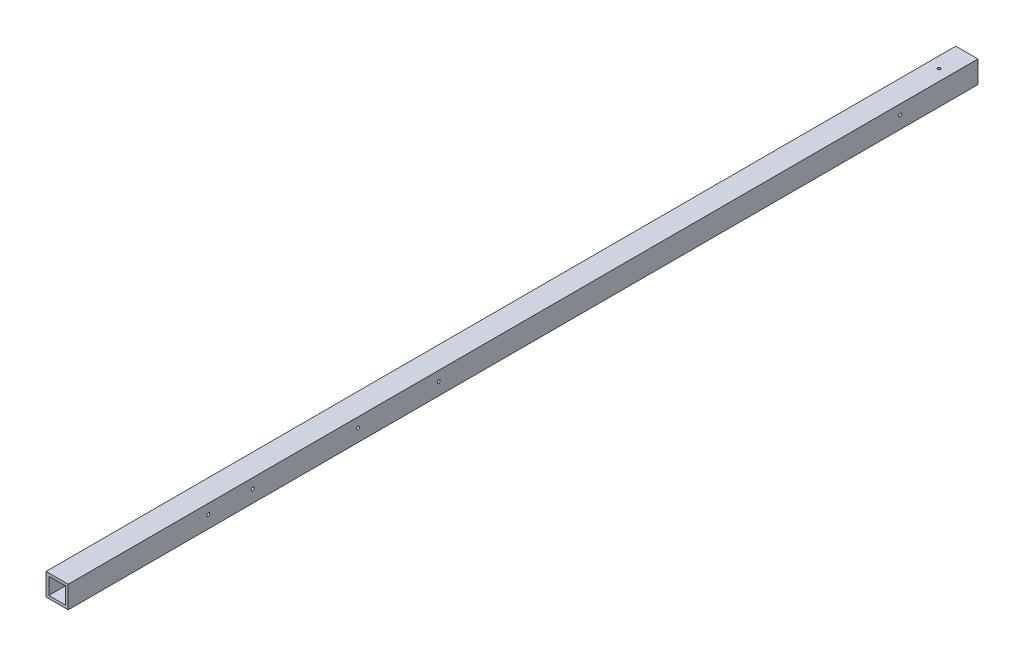
ISO-10303-21;
HEADER;
FILE_DESCRIPTION(('STEP AP214'),'2;1');
FILE_NAME('part.step','',(''),(''),'','','');
FILE_SCHEMA(('AUTOMOTIVE_DESIGN { 1 0 10303 214 1 1 1 1 }'));
ENDSEC;
DATA;
#1=APPLICATION_CONTEXT('core data for automotive mechanical design processes');
#2=APPLICATION_PROTOCOL_DEFINITION('international standard','automotive_design',2000,#1);
#3=PRODUCT_CONTEXT('',#1,'mechanical');
#4=PRODUCT('Part','Part','',(#3));
#5=PRODUCT_RELATED_PRODUCT_CATEGORY('part','',(#4));
#6=PRODUCT_DEFINITION_FORMATION('','',#4);
#7=PRODUCT_DEFINITION_CONTEXT('part definition',#1,'design');
#8=PRODUCT_DEFINITION('design','',#6,#7);
#9=PRODUCT_DEFINITION_SHAPE('','',#8);
#10=(LENGTH_UNIT() NAMED_UNIT(*) SI_UNIT(.MILLI.,.METRE.));
#11=(NAMED_UNIT(*) PLANE_ANGLE_UNIT() SI_UNIT($,.RADIAN.));
#12=(NAMED_UNIT(*) SI_UNIT($,.STERADIAN.) SOLID_ANGLE_UNIT());
#13=UNCERTAINTY_MEASURE_WITH_UNIT(LENGTH_MEASURE(1.E-05),#10,'distance_accuracy_value','');
#14=(GEOMETRIC_REPRESENTATION_CONTEXT(3) GLOBAL_UNCERTAINTY_ASSIGNED_CONTEXT((#13)) GLOBAL_UNIT_ASSIGNED_CONTEXT((#10,
#11,#12)) REPRESENTATION_CONTEXT('',''));
#15=CARTESIAN_POINT('',(0.,0.,0.));
#16=DIRECTION('',(0.,0.,1.));
#17=DIRECTION('',(1.,0.,0.));
#18=AXIS2_PLACEMENT_3D('',#15,#16,#17);
#19=CARTESIAN_POINT('',(-2287.62139438171,193.675,1762.125));
#20=DIRECTION('',(1.,0.,0.));
#21=DIRECTION('',(0.,0.,-1.));
#22=AXIS2_PLACEMENT_3D('',#19,#20,#21);
#23=CYLINDRICAL_SURFACE('',#22,3.3782);
#24=CARTESIAN_POINT('',(-209.55,193.675,1762.125));
#25=DIRECTION('',(-1.,0.,0.));
#26=DIRECTION('',(0.,0.,-1.));
#27=AXIS2_PLACEMENT_3D('',#24,#25,#26);
#28=CIRCLE('',#27,3.3782);
#29=CARTESIAN_POINT('',(-209.55,193.675,1758.7468));
#30=VERTEX_POINT('',#29);
#31=EDGE_CURVE('E197',#30,#30,#28,.F.);
#32=ORIENTED_EDGE('',*,*,#31,.T.);
#33=EDGE_LOOP('',(#32));
#34=FACE_BOUND('',#33,.T.);
#35=CARTESIAN_POINT('',(-212.028435125498,193.675,1762.125));
#36=DIRECTION('',(1.,0.,0.));
#37=DIRECTION('',(0.,0.,1.));
#38=AXIS2_PLACEMENT_3D('',#35,#36,#37);
#39=CIRCLE('',#38,3.3782);
#40=CARTESIAN_POINT('',(-212.028435125498,193.675,1765.5032));
#41=VERTEX_POINT('',#40);
#42=EDGE_CURVE('E261',#41,#41,#39,.T.);
#43=ORIENTED_EDGE('',*,*,#42,.F.);
#44=EDGE_LOOP('',(#43));
#45=FACE_BOUND('',#44,.T.);
#46=ADVANCED_FACE('F16',(#34,#45),#23,.F.);
#47=CARTESIAN_POINT('',(-2287.62139438171,193.675,1660.525));
#48=DIRECTION('',(1.,0.,0.));
#49=DIRECTION('',(0.,0.,-1.));
#50=AXIS2_PLACEMENT_3D('',#47,#48,#49);
#51=CYLINDRICAL_SURFACE('',#50,3.3782);
#52=CARTESIAN_POINT('',(-209.55,193.675,1660.525));
#53=DIRECTION('',(-1.,0.,0.));
#54=DIRECTION('',(0.,0.,-1.));
#55=AXIS2_PLACEMENT_3D('',#52,#53,#54);
#56=CIRCLE('',#55,3.3782);
#57=CARTESIAN_POINT('',(-209.55,193.675,1657.1468));
#58=VERTEX_POINT('',#57);
#59=EDGE_CURVE('E203',#58,#58,#56,.F.);
#60=ORIENTED_EDGE('',*,*,#59,.T.);
#61=EDGE_LOOP('',(#60));
#62=FACE_BOUND('',#61,.T.);
#63=CARTESIAN_POINT('',(-212.028435125498,193.675,1660.525));
#64=DIRECTION('',(1.,0.,0.));
#65=DIRECTION('',(0.,0.,1.));
#66=AXIS2_PLACEMENT_3D('',#63,#64,#65);
#67=CIRCLE('',#66,3.3782);
#68=CARTESIAN_POINT('',(-212.028435125498,193.675,1663.9032));
#69=VERTEX_POINT('',#68);
#70=EDGE_CURVE('E208',#69,#69,#67,.T.);
#71=ORIENTED_EDGE('',*,*,#70,.F.);
#72=EDGE_LOOP('',(#71));
#73=FACE_BOUND('',#72,.T.);
#74=ADVANCED_FACE('F339',(#62,#73),#51,.F.);
#75=CARTESIAN_POINT('',(-190.5,171.45,2082.8));
#76=DIRECTION('',(0.,1.,0.));
#77=DIRECTION('',(0.,0.,-1.));
#78=AXIS2_PLACEMENT_3D('',#75,#76,#77);
#79=PLANE('',#78);
#80=CARTESIAN_POINT('',(-190.5,171.45,63.5));
#81=DIRECTION('',(0.,-1.,0.));
#82=DIRECTION('',(0.,0.,-1.));
#83=AXIS2_PLACEMENT_3D('',#80,#81,#82);
#84=CIRCLE('',#83,3.3655);
#85=CARTESIAN_POINT('',(-190.5,171.45,60.1345));
#86=VERTEX_POINT('',#85);
#87=EDGE_CURVE('E150',#86,#86,#84,.F.);
#88=ORIENTED_EDGE('',*,*,#87,.F.);
#89=EDGE_LOOP('',(#88));
#90=FACE_BOUND('',#89,.T.);
#91=DIRECTION('',(-1.,0.,0.));
#92=VECTOR('',#91,1.);
#93=CARTESIAN_POINT('',(-190.5,171.45,0.));
#94=LINE('',#93,#92);
#95=CARTESIAN_POINT('',(-171.45,171.45,0.));
#96=VERTEX_POINT('',#95);
#97=CARTESIAN_POINT('',(-209.55,171.45,0.));
#98=VERTEX_POINT('',#97);
#99=EDGE_CURVE('E161',#96,#98,#94,.T.);
#100=ORIENTED_EDGE('',*,*,#99,.T.);
#101=DIRECTION('',(0.,0.,-1.));
#102=VECTOR('',#101,1.);
#103=CARTESIAN_POINT('',(-209.55,171.45,2082.8));
#104=LINE('',#103,#102);
#105=CARTESIAN_POINT('',(-209.55,171.45,2082.8));
#106=VERTEX_POINT('',#105);
#107=EDGE_CURVE('E171',#106,#98,#104,.T.);
#108=ORIENTED_EDGE('',*,*,#107,.F.);
#109=DIRECTION('',(-1.,0.,0.));
#110=VECTOR('',#109,1.);
#111=CARTESIAN_POINT('',(-190.5,171.45,2082.8));
#112=LINE('',#111,#110);
#113=CARTESIAN_POINT('',(-171.45,171.45,2082.8));
#114=VERTEX_POINT('',#113);
#115=EDGE_CURVE('E132',#114,#106,#112,.T.);
#116=ORIENTED_EDGE('',*,*,#115,.F.);
#117=DIRECTION('',(0.,0.,-1.));
#118=VECTOR('',#117,1.);
#119=CARTESIAN_POINT('',(-171.45,171.45,2082.8));
#120=LINE('',#119,#118);
#121=EDGE_CURVE('E11',#114,#96,#120,.T.);
#122=ORIENTED_EDGE('',*,*,#121,.T.);
#123=EDGE_LOOP('',(#100,#108,#116,#122));
#124=FACE_BOUND('',#123,.T.);
#125=ADVANCED_FACE('F322',(#90,#124),#79,.T.);
#126=CARTESIAN_POINT('',(-171.45,190.5,2082.8));
#127=DIRECTION('',(1.,0.,0.));
#128=DIRECTION('',(0.,0.,-1.));
#129=AXIS2_PLACEMENT_3D('',#126,#127,#128);
#130=PLANE('',#129);
#131=CARTESIAN_POINT('',(-171.45,193.675,1419.225));
#132=DIRECTION('',(1.,0.,0.));
#133=DIRECTION('',(0.,0.,-1.));
#134=AXIS2_PLACEMENT_3D('',#131,#132,#133);
#135=CIRCLE('',#134,3.3782);
#136=CARTESIAN_POINT('',(-171.45,193.675,1415.8468));
#137=VERTEX_POINT('',#136);
#138=EDGE_CURVE('E236',#137,#137,#135,.F.);
#139=ORIENTED_EDGE('',*,*,#138,.F.);
#140=EDGE_LOOP('',(#139));
#141=FACE_BOUND('',#140,.T.);
#142=CARTESIAN_POINT('',(-171.45,193.675,177.8));
#143=DIRECTION('',(-1.,0.,0.));
#144=DIRECTION('',(0.,0.,-1.));
#145=AXIS2_PLACEMENT_3D('',#142,#143,#144);
#146=CIRCLE('',#145,3.3782);
#147=CARTESIAN_POINT('',(-171.45,193.675,174.4218));
#148=VERTEX_POINT('',#147);
#149=EDGE_CURVE('E225',#148,#148,#146,.F.);
#150=ORIENTED_EDGE('',*,*,#149,.T.);
#151=EDGE_LOOP('',(#150));
#152=FACE_BOUND('',#151,.T.);
#153=CARTESIAN_POINT('',(-171.45,193.675,1234.5416));
#154=DIRECTION('',(-1.,0.,0.));
#155=DIRECTION('',(0.,0.,-1.));
#156=AXIS2_PLACEMENT_3D('',#153,#154,#155);
#157=CIRCLE('',#156,3.3782);
#158=CARTESIAN_POINT('',(-171.45,193.675,1231.1634));
#159=VERTEX_POINT('',#158);
#160=EDGE_CURVE('E253',#159,#159,#157,.F.);
#161=ORIENTED_EDGE('',*,*,#160,.T.);
#162=EDGE_LOOP('',(#161));
#163=FACE_BOUND('',#162,.T.);
#164=CARTESIAN_POINT('',(-171.45,193.675,1660.525));
#165=DIRECTION('',(-1.,0.,0.));
#166=DIRECTION('',(0.,0.,-1.));
#167=AXIS2_PLACEMENT_3D('',#164,#165,#166);
#168=CIRCLE('',#167,3.3782);
#169=CARTESIAN_POINT('',(-171.45,193.675,1657.1468));
#170=VERTEX_POINT('',#169);
#171=EDGE_CURVE('E202',#170,#170,#168,.F.);
#172=ORIENTED_EDGE('',*,*,#171,.T.);
#173=EDGE_LOOP('',(#172));
#174=FACE_BOUND('',#173,.T.);
#175=CARTESIAN_POINT('',(-171.45,193.675,1762.125));
#176=DIRECTION('',(-1.,0.,0.));
#177=DIRECTION('',(0.,0.,-1.));
#178=AXIS2_PLACEMENT_3D('',#175,#176,#177);
#179=CIRCLE('',#178,3.3782);
#180=CARTESIAN_POINT('',(-171.45,193.675,1758.7468));
#181=VERTEX_POINT('',#180);
#182=EDGE_CURVE('E281',#181,#181,#179,.F.);
#183=ORIENTED_EDGE('',*,*,#182,.T.);
#184=EDGE_LOOP('',(#183));
#185=FACE_BOUND('',#184,.T.);
#186=DIRECTION('',(0.,1.,0.));
#187=VECTOR('',#186,1.);
#188=CARTESIAN_POINT('',(-171.45,190.5,0.));
#189=LINE('',#188,#187);
#190=CARTESIAN_POINT('',(-171.45,209.55,0.));
#191=VERTEX_POINT('',#190);
#192=EDGE_CURVE('E165',#96,#191,#189,.T.);
#193=ORIENTED_EDGE('',*,*,#192,.F.);
#194=ORIENTED_EDGE('',*,*,#121,.F.);
#195=DIRECTION('',(0.,1.,0.));
#196=VECTOR('',#195,1.);
#197=CARTESIAN_POINT('',(-171.45,190.5,2082.8));
#198=LINE('',#197,#196);
#199=CARTESIAN_POINT('',(-171.45,209.55,2082.8));
#200=VERTEX_POINT('',#199);
#201=EDGE_CURVE('E116',#114,#200,#198,.T.);
#202=ORIENTED_EDGE('',*,*,#201,.T.);
#203=DIRECTION('',(0.,0.,-1.));
#204=VECTOR('',#203,1.);
#205=CARTESIAN_POINT('',(-171.45,209.55,2082.8));
#206=LINE('',#205,#204);
#207=EDGE_CURVE('E27',#200,#191,#206,.T.);
#208=ORIENTED_EDGE('',*,*,#207,.T.);
#209=EDGE_LOOP('',(#193,#194,#202,#208));
#210=FACE_BOUND('',#209,.T.);
#211=ADVANCED_FACE('F129',(#141,#152,#163,#174,#185,#210),#130,.F.);
#212=CARTESIAN_POINT('',(-190.5,209.55,2082.8));
#213=DIRECTION('',(0.,1.,0.));
#214=DIRECTION('',(0.,0.,-1.));
#215=AXIS2_PLACEMENT_3D('',#212,#213,#214);
#216=PLANE('',#215);
#217=CARTESIAN_POINT('',(-190.5,209.55,63.5));
#218=DIRECTION('',(0.,-1.,0.));
#219=DIRECTION('',(0.,0.,-1.));
#220=AXIS2_PLACEMENT_3D('',#217,#218,#219);
#221=CIRCLE('',#220,3.3655);
#222=CARTESIAN_POINT('',(-190.5,209.55,60.1345));
#223=VERTEX_POINT('',#222);
#224=EDGE_CURVE('E195',#223,#223,#221,.F.);
#225=ORIENTED_EDGE('',*,*,#224,.T.);
#226=EDGE_LOOP('',(#225));
#227=FACE_BOUND('',#226,.T.);
#228=DIRECTION('',(-1.,0.,0.));
#229=VECTOR('',#228,1.);
#230=CARTESIAN_POINT('',(-190.5,209.55,0.));
#231=LINE('',#230,#229);
#232=CARTESIAN_POINT('',(-209.55,209.55,0.));
#233=VERTEX_POINT('',#232);
#234=EDGE_CURVE('E123',#191,#233,#231,.T.);
#235=ORIENTED_EDGE('',*,*,#234,.F.);
#236=ORIENTED_EDGE('',*,*,#207,.F.);
#237=DIRECTION('',(-1.,0.,0.));
#238=VECTOR('',#237,1.);
#239=CARTESIAN_POINT('',(-190.5,209.55,2082.8));
#240=LINE('',#239,#238);
#241=CARTESIAN_POINT('',(-209.55,209.55,2082.8));
#242=VERTEX_POINT('',#241);
#243=EDGE_CURVE('E112',#200,#242,#240,.T.);
#244=ORIENTED_EDGE('',*,*,#243,.T.);
#245=DIRECTION('',(0.,0.,-1.));
#246=VECTOR('',#245,1.);
#247=CARTESIAN_POINT('',(-209.55,209.55,2082.8));
#248=LINE('',#247,#246);
#249=EDGE_CURVE('E127',#242,#233,#248,.T.);
#250=ORIENTED_EDGE('',*,*,#249,.T.);
#251=EDGE_LOOP('',(#235,#236,#244,#250));
#252=FACE_BOUND('',#251,.T.);
#253=ADVANCED_FACE('F122',(#227,#252),#216,.F.);
#254=CARTESIAN_POINT('',(-215.9,190.5,2082.8));
#255=DIRECTION('',(-1.,0.,0.));
#256=DIRECTION('',(0.,0.,1.));
#257=AXIS2_PLACEMENT_3D('',#254,#255,#256);
#258=PLANE('',#257);
#259=CARTESIAN_POINT('',(-215.9,193.675,1419.225));
#260=DIRECTION('',(-1.,0.,0.));
#261=DIRECTION('',(0.,0.,1.));
#262=AXIS2_PLACEMENT_3D('',#259,#260,#261);
#263=CIRCLE('',#262,6.74369999999991);
#264=CARTESIAN_POINT('',(-215.9,193.675,1425.9687));
#265=VERTEX_POINT('',#264);
#266=EDGE_CURVE('E394',#265,#265,#263,.T.);
#267=ORIENTED_EDGE('',*,*,#266,.F.);
#268=EDGE_LOOP('',(#267));
#269=FACE_BOUND('',#268,.T.);
#270=CARTESIAN_POINT('',(-215.9,193.675,177.8));
#271=DIRECTION('',(1.,0.,0.));
#272=DIRECTION('',(0.,0.,1.));
#273=AXIS2_PLACEMENT_3D('',#270,#271,#272);
#274=CIRCLE('',#273,6.7437);
#275=CARTESIAN_POINT('',(-215.9,193.675,184.5437));
#276=VERTEX_POINT('',#275);
#277=EDGE_CURVE('E229',#276,#276,#274,.T.);
#278=ORIENTED_EDGE('',*,*,#277,.T.);
#279=EDGE_LOOP('',(#278));
#280=FACE_BOUND('',#279,.T.);
#281=CARTESIAN_POINT('',(-215.9,193.675,1234.5416));
#282=DIRECTION('',(1.,0.,0.));
#283=DIRECTION('',(0.,0.,1.));
#284=AXIS2_PLACEMENT_3D('',#281,#282,#283);
#285=CIRCLE('',#284,6.74369999999991);
#286=CARTESIAN_POINT('',(-215.9,193.675,1241.2853));
#287=VERTEX_POINT('',#286);
#288=EDGE_CURVE('E243',#287,#287,#285,.T.);
#289=ORIENTED_EDGE('',*,*,#288,.T.);
#290=EDGE_LOOP('',(#289));
#291=FACE_BOUND('',#290,.T.);
#292=CARTESIAN_POINT('',(-215.9,193.675,1762.125));
#293=DIRECTION('',(1.,0.,0.));
#294=DIRECTION('',(0.,0.,1.));
#295=AXIS2_PLACEMENT_3D('',#292,#293,#294);
#296=CIRCLE('',#295,6.74369999999991);
#297=CARTESIAN_POINT('',(-215.9,193.675,1768.8687));
#298=VERTEX_POINT('',#297);
#299=EDGE_CURVE('E257',#298,#298,#296,.T.);
#300=ORIENTED_EDGE('',*,*,#299,.T.);
#301=EDGE_LOOP('',(#300));
#302=FACE_BOUND('',#301,.T.);
#303=CARTESIAN_POINT('',(-215.9,193.675,1660.525));
#304=DIRECTION('',(1.,0.,0.));
#305=DIRECTION('',(0.,0.,1.));
#306=AXIS2_PLACEMENT_3D('',#303,#304,#305);
#307=CIRCLE('',#306,6.74369999999991);
#308=CARTESIAN_POINT('',(-215.9,193.675,1667.2687));
#309=VERTEX_POINT('',#308);
#310=EDGE_CURVE('E265',#309,#309,#307,.T.);
#311=ORIENTED_EDGE('',*,*,#310,.T.);
#312=EDGE_LOOP('',(#311));
#313=FACE_BOUND('',#312,.T.);
#314=DIRECTION('',(0.,-1.,0.));
#315=VECTOR('',#314,1.);
#316=CARTESIAN_POINT('',(-215.9,190.5,0.));
#317=LINE('',#316,#315);
#318=CARTESIAN_POINT('',(-215.9,215.9,0.));
#319=VERTEX_POINT('',#318);
#320=CARTESIAN_POINT('',(-215.9,165.1,0.));
#321=VERTEX_POINT('',#320);
#322=EDGE_CURVE('E145',#319,#321,#317,.T.);
#323=ORIENTED_EDGE('',*,*,#322,.T.);
#324=DIRECTION('',(0.,0.,-1.));
#325=VECTOR('',#324,1.);
#326=CARTESIAN_POINT('',(-215.9,165.1,2082.8));
#327=LINE('',#326,#325);
#328=CARTESIAN_POINT('',(-215.9,165.1,2082.8));
#329=VERTEX_POINT('',#328);
#330=EDGE_CURVE('E144',#329,#321,#327,.T.);
#331=ORIENTED_EDGE('',*,*,#330,.F.);
#332=DIRECTION('',(0.,-1.,0.));
#333=VECTOR('',#332,1.);
#334=CARTESIAN_POINT('',(-215.9,190.5,2082.8));
#335=LINE('',#334,#333);
#336=CARTESIAN_POINT('',(-215.9,215.9,2082.8));
#337=VERTEX_POINT('',#336);
#338=EDGE_CURVE('E170',#337,#329,#335,.T.);
#339=ORIENTED_EDGE('',*,*,#338,.F.);
#340=DIRECTION('',(0.,0.,-1.));
#341=VECTOR('',#340,1.);
#342=CARTESIAN_POINT('',(-215.9,215.9,2082.8));
#343=LINE('',#342,#341);
#344=EDGE_CURVE('E174',#337,#319,#343,.T.);
#345=ORIENTED_EDGE('',*,*,#344,.T.);
#346=EDGE_LOOP('',(#323,#331,#339,#345));
#347=FACE_BOUND('',#346,.T.);
#348=ADVANCED_FACE('F18',(#269,#280,#291,#302,#313,#347),#258,.T.);
#349=CARTESIAN_POINT('',(-190.5,215.9,2082.8));
#350=DIRECTION('',(0.,-1.,0.));
#351=DIRECTION('',(0.,0.,1.));
#352=AXIS2_PLACEMENT_3D('',#349,#350,#351);
#353=PLANE('',#352);
#354=CARTESIAN_POINT('',(-190.5,215.9,63.5));
#355=DIRECTION('',(0.,-1.,0.));
#356=DIRECTION('',(0.,0.,-1.));
#357=AXIS2_PLACEMENT_3D('',#354,#355,#356);
#358=CIRCLE('',#357,3.3655);
#359=CARTESIAN_POINT('',(-190.5,215.9,60.1345));
#360=VERTEX_POINT('',#359);
#361=EDGE_CURVE('E196',#360,#360,#358,.T.);
#362=ORIENTED_EDGE('',*,*,#361,.T.);
#363=EDGE_LOOP('',(#362));
#364=FACE_BOUND('',#363,.T.);
#365=DIRECTION('',(1.,0.,0.));
#366=VECTOR('',#365,1.);
#367=CARTESIAN_POINT('',(-190.5,215.9,0.));
#368=LINE('',#367,#366);
#369=CARTESIAN_POINT('',(-165.1,215.9,0.));
#370=VERTEX_POINT('',#369);
#371=EDGE_CURVE('E149',#319,#370,#368,.T.);
#372=ORIENTED_EDGE('',*,*,#371,.F.);
#373=ORIENTED_EDGE('',*,*,#344,.F.);
#374=DIRECTION('',(1.,0.,0.));
#375=VECTOR('',#374,1.);
#376=CARTESIAN_POINT('',(-190.5,215.9,2082.8));
#377=LINE('',#376,#375);
#378=CARTESIAN_POINT('',(-165.1,215.9,2082.8));
#379=VERTEX_POINT('',#378);
#380=EDGE_CURVE('E93',#337,#379,#377,.T.);
#381=ORIENTED_EDGE('',*,*,#380,.T.);
#382=DIRECTION('',(0.,0.,-1.));
#383=VECTOR('',#382,1.);
#384=CARTESIAN_POINT('',(-165.1,215.9,2082.8));
#385=LINE('',#384,#383);
#386=EDGE_CURVE('E184',#379,#370,#385,.T.);
#387=ORIENTED_EDGE('',*,*,#386,.T.);
#388=EDGE_LOOP('',(#372,#373,#381,#387));
#389=FACE_BOUND('',#388,.T.);
#390=ADVANCED_FACE('F312',(#364,#389),#353,.F.);
#391=CARTESIAN_POINT('',(-165.1,190.5,2082.8));
#392=DIRECTION('',(-1.,0.,0.));
#393=DIRECTION('',(0.,0.,1.));
#394=AXIS2_PLACEMENT_3D('',#391,#392,#393);
#395=PLANE('',#394);
#396=CARTESIAN_POINT('',(-165.1,193.675,1419.225));
#397=DIRECTION('',(-1.,0.,0.));
#398=DIRECTION('',(0.,0.,1.));
#399=AXIS2_PLACEMENT_3D('',#396,#397,#398);
#400=CIRCLE('',#399,3.3782);
#401=CARTESIAN_POINT('',(-165.1,193.675,1422.6032));
#402=VERTEX_POINT('',#401);
#403=EDGE_CURVE('E455',#402,#402,#400,.F.);
#404=ORIENTED_EDGE('',*,*,#403,.F.);
#405=EDGE_LOOP('',(#404));
#406=FACE_BOUND('',#405,.T.);
#407=CARTESIAN_POINT('',(-165.1,193.675,177.8));
#408=DIRECTION('',(1.,0.,0.));
#409=DIRECTION('',(0.,0.,1.));
#410=AXIS2_PLACEMENT_3D('',#407,#408,#409);
#411=CIRCLE('',#410,3.3782);
#412=CARTESIAN_POINT('',(-165.1,193.675,181.1782));
#413=VERTEX_POINT('',#412);
#414=EDGE_CURVE('E217',#413,#413,#411,.F.);
#415=ORIENTED_EDGE('',*,*,#414,.T.);
#416=EDGE_LOOP('',(#415));
#417=FACE_BOUND('',#416,.T.);
#418=CARTESIAN_POINT('',(-165.1,193.675,1234.5416));
#419=DIRECTION('',(1.,0.,0.));
#420=DIRECTION('',(0.,0.,1.));
#421=AXIS2_PLACEMENT_3D('',#418,#419,#420);
#422=CIRCLE('',#421,3.3782);
#423=CARTESIAN_POINT('',(-165.1,193.675,1237.9198));
#424=VERTEX_POINT('',#423);
#425=EDGE_CURVE('E212',#424,#424,#422,.F.);
#426=ORIENTED_EDGE('',*,*,#425,.T.);
#427=EDGE_LOOP('',(#426));
#428=FACE_BOUND('',#427,.T.);
#429=CARTESIAN_POINT('',(-165.1,193.675,1660.525));
#430=DIRECTION('',(1.,0.,0.));
#431=DIRECTION('',(0.,0.,1.));
#432=AXIS2_PLACEMENT_3D('',#429,#430,#431);
#433=CIRCLE('',#432,3.3782);
#434=CARTESIAN_POINT('',(-165.1,193.675,1663.9032));
#435=VERTEX_POINT('',#434);
#436=EDGE_CURVE('E207',#435,#435,#433,.F.);
#437=ORIENTED_EDGE('',*,*,#436,.T.);
#438=EDGE_LOOP('',(#437));
#439=FACE_BOUND('',#438,.T.);
#440=CARTESIAN_POINT('',(-165.1,193.675,1762.125));
#441=DIRECTION('',(1.,0.,0.));
#442=DIRECTION('',(0.,0.,1.));
#443=AXIS2_PLACEMENT_3D('',#440,#441,#442);
#444=CIRCLE('',#443,3.3782);
#445=CARTESIAN_POINT('',(-165.1,193.675,1765.5032));
#446=VERTEX_POINT('',#445);
#447=EDGE_CURVE('E201',#446,#446,#444,.F.);
#448=ORIENTED_EDGE('',*,*,#447,.T.);
#449=EDGE_LOOP('',(#448));
#450=FACE_BOUND('',#449,.T.);
#451=DIRECTION('',(0.,-1.,0.));
#452=VECTOR('',#451,1.);
#453=CARTESIAN_POINT('',(-165.1,190.5,0.));
#454=LINE('',#453,#452);
#455=CARTESIAN_POINT('',(-165.1,165.1,0.));
#456=VERTEX_POINT('',#455);
#457=EDGE_CURVE('E154',#370,#456,#454,.T.);
#458=ORIENTED_EDGE('',*,*,#457,.F.);
#459=ORIENTED_EDGE('',*,*,#386,.F.);
#460=DIRECTION('',(0.,-1.,0.));
#461=VECTOR('',#460,1.);
#462=CARTESIAN_POINT('',(-165.1,190.5,2082.8));
#463=LINE('',#462,#461);
#464=CARTESIAN_POINT('',(-165.1,165.1,2082.8));
#465=VERTEX_POINT('',#464);
#466=EDGE_CURVE('E298',#379,#465,#463,.T.);
#467=ORIENTED_EDGE('',*,*,#466,.T.);
#468=DIRECTION('',(0.,0.,-1.));
#469=VECTOR('',#468,1.);
#470=CARTESIAN_POINT('',(-165.1,165.1,2082.8));
#471=LINE('',#470,#469);
#472=EDGE_CURVE('E180',#465,#456,#471,.T.);
#473=ORIENTED_EDGE('',*,*,#472,.T.);
#474=EDGE_LOOP('',(#458,#459,#467,#473));
#475=FACE_BOUND('',#474,.T.);
#476=ADVANCED_FACE('F310',(#406,#417,#428,#439,#450,#475),#395,.F.);
#477=CARTESIAN_POINT('',(-190.5,165.1,2082.8));
#478=DIRECTION('',(0.,-1.,0.));
#479=DIRECTION('',(0.,0.,1.));
#480=AXIS2_PLACEMENT_3D('',#477,#478,#479);
#481=PLANE('',#480);
#482=CARTESIAN_POINT('',(-190.5,165.1,63.5));
#483=DIRECTION('',(0.,1.,0.));
#484=DIRECTION('',(0.,0.,1.));
#485=AXIS2_PLACEMENT_3D('',#482,#483,#484);
#486=CIRCLE('',#485,3.3655);
#487=CARTESIAN_POINT('',(-190.5,165.1,66.8655));
#488=VERTEX_POINT('',#487);
#489=EDGE_CURVE('E191',#488,#488,#486,.F.);
#490=ORIENTED_EDGE('',*,*,#489,.F.);
#491=EDGE_LOOP('',(#490));
#492=FACE_BOUND('',#491,.T.);
#493=DIRECTION('',(1.,0.,0.));
#494=VECTOR('',#493,1.);
#495=CARTESIAN_POINT('',(-190.5,165.1,0.));
#496=LINE('',#495,#494);
#497=EDGE_CURVE('E158',#321,#456,#496,.T.);
#498=ORIENTED_EDGE('',*,*,#497,.T.);
#499=ORIENTED_EDGE('',*,*,#472,.F.);
#500=DIRECTION('',(1.,0.,0.));
#501=VECTOR('',#500,1.);
#502=CARTESIAN_POINT('',(-190.5,165.1,2082.8));
#503=LINE('',#502,#501);
#504=EDGE_CURVE('E138',#329,#465,#503,.T.);
#505=ORIENTED_EDGE('',*,*,#504,.F.);
#506=ORIENTED_EDGE('',*,*,#330,.T.);
#507=EDGE_LOOP('',(#498,#499,#505,#506));
#508=FACE_BOUND('',#507,.T.);
#509=ADVANCED_FACE('F308',(#492,#508),#481,.T.);
#510=CARTESIAN_POINT('',(-209.55,190.5,2082.8));
#511=DIRECTION('',(1.,0.,0.));
#512=DIRECTION('',(0.,0.,-1.));
#513=AXIS2_PLACEMENT_3D('',#510,#511,#512);
#514=PLANE('',#513);
#515=CARTESIAN_POINT('',(-209.55,193.675,1419.225));
#516=DIRECTION('',(1.,0.,0.));
#517=DIRECTION('',(0.,0.,-1.));
#518=AXIS2_PLACEMENT_3D('',#515,#516,#517);
#519=CIRCLE('',#518,3.3782);
#520=CARTESIAN_POINT('',(-209.55,193.675,1415.8468));
#521=VERTEX_POINT('',#520);
#522=EDGE_CURVE('E20',#521,#521,#519,.F.);
#523=ORIENTED_EDGE('',*,*,#522,.T.);
#524=EDGE_LOOP('',(#523));
#525=FACE_BOUND('',#524,.T.);
#526=CARTESIAN_POINT('',(-209.55,193.675,177.8));
#527=DIRECTION('',(-1.,0.,0.));
#528=DIRECTION('',(0.,0.,-1.));
#529=AXIS2_PLACEMENT_3D('',#526,#527,#528);
#530=CIRCLE('',#529,3.3782);
#531=CARTESIAN_POINT('',(-209.55,193.675,174.4218));
#532=VERTEX_POINT('',#531);
#533=EDGE_CURVE('E214',#532,#532,#530,.F.);
#534=ORIENTED_EDGE('',*,*,#533,.F.);
#535=EDGE_LOOP('',(#534));
#536=FACE_BOUND('',#535,.T.);
#537=CARTESIAN_POINT('',(-209.55,193.675,1234.5416));
#538=DIRECTION('',(-1.,0.,0.));
#539=DIRECTION('',(0.,0.,-1.));
#540=AXIS2_PLACEMENT_3D('',#537,#538,#539);
#541=CIRCLE('',#540,3.3782);
#542=CARTESIAN_POINT('',(-209.55,193.675,1231.1634));
#543=VERTEX_POINT('',#542);
#544=EDGE_CURVE('E209',#543,#543,#541,.F.);
#545=ORIENTED_EDGE('',*,*,#544,.F.);
#546=EDGE_LOOP('',(#545));
#547=FACE_BOUND('',#546,.T.);
#548=ORIENTED_EDGE('',*,*,#59,.F.);
#549=EDGE_LOOP('',(#548));
#550=FACE_BOUND('',#549,.T.);
#551=ORIENTED_EDGE('',*,*,#31,.F.);
#552=EDGE_LOOP('',(#551));
#553=FACE_BOUND('',#552,.T.);
#554=DIRECTION('',(0.,1.,0.));
#555=VECTOR('',#554,1.);
#556=CARTESIAN_POINT('',(-209.55,190.5,0.));
#557=LINE('',#556,#555);
#558=EDGE_CURVE('E76',#98,#233,#557,.T.);
#559=ORIENTED_EDGE('',*,*,#558,.T.);
#560=ORIENTED_EDGE('',*,*,#249,.F.);
#561=DIRECTION('',(0.,1.,0.));
#562=VECTOR('',#561,1.);
#563=CARTESIAN_POINT('',(-209.55,190.5,2082.8));
#564=LINE('',#563,#562);
#565=EDGE_CURVE('E41',#106,#242,#564,.T.);
#566=ORIENTED_EDGE('',*,*,#565,.F.);
#567=ORIENTED_EDGE('',*,*,#107,.T.);
#568=EDGE_LOOP('',(#559,#560,#566,#567));
#569=FACE_BOUND('',#568,.T.);
#570=ADVANCED_FACE('F323',(#525,#536,#547,#550,#553,#569),#514,.T.);
#571=CARTESIAN_POINT('',(-190.5,190.5,2082.8));
#572=DIRECTION('',(0.,0.,1.));
#573=DIRECTION('',(1.,0.,0.));
#574=AXIS2_PLACEMENT_3D('',#571,#572,#573);
#575=PLANE('',#574);
#576=ORIENTED_EDGE('',*,*,#338,.T.);
#577=ORIENTED_EDGE('',*,*,#504,.T.);
#578=ORIENTED_EDGE('',*,*,#466,.F.);
#579=ORIENTED_EDGE('',*,*,#380,.F.);
#580=EDGE_LOOP('',(#576,#577,#578,#579));
#581=FACE_BOUND('',#580,.T.);
#582=ORIENTED_EDGE('',*,*,#115,.T.);
#583=ORIENTED_EDGE('',*,*,#565,.T.);
#584=ORIENTED_EDGE('',*,*,#243,.F.);
#585=ORIENTED_EDGE('',*,*,#201,.F.);
#586=EDGE_LOOP('',(#582,#583,#584,#585));
#587=FACE_BOUND('',#586,.T.);
#588=ADVANCED_FACE('F114',(#581,#587),#575,.T.);
#589=CARTESIAN_POINT('',(-190.5,190.5,0.));
#590=DIRECTION('',(0.,0.,1.));
#591=DIRECTION('',(1.,0.,0.));
#592=AXIS2_PLACEMENT_3D('',#589,#590,#591);
#593=PLANE('',#592);
#594=ORIENTED_EDGE('',*,*,#322,.F.);
#595=ORIENTED_EDGE('',*,*,#371,.T.);
#596=ORIENTED_EDGE('',*,*,#457,.T.);
#597=ORIENTED_EDGE('',*,*,#497,.F.);
#598=EDGE_LOOP('',(#594,#595,#596,#597));
#599=FACE_BOUND('',#598,.T.);
#600=ORIENTED_EDGE('',*,*,#99,.F.);
#601=ORIENTED_EDGE('',*,*,#192,.T.);
#602=ORIENTED_EDGE('',*,*,#234,.T.);
#603=ORIENTED_EDGE('',*,*,#558,.F.);
#604=EDGE_LOOP('',(#600,#601,#602,#603));
#605=FACE_BOUND('',#604,.T.);
#606=ADVANCED_FACE('F316',(#599,#605),#593,.F.);
#607=CARTESIAN_POINT('',(-190.5,-1869.1497542781,63.5));
#608=DIRECTION('',(0.,1.,0.));
#609=DIRECTION('',(0.,0.,-1.));
#610=AXIS2_PLACEMENT_3D('',#607,#608,#609);
#611=CYLINDRICAL_SURFACE('',#610,3.3655);
#612=ORIENTED_EDGE('',*,*,#87,.T.);
#613=EDGE_LOOP('',(#612));
#614=FACE_BOUND('',#613,.T.);
#615=ORIENTED_EDGE('',*,*,#489,.T.);
#616=EDGE_LOOP('',(#615));
#617=FACE_BOUND('',#616,.T.);
#618=ADVANCED_FACE('F318',(#614,#617),#611,.F.);
#619=ORIENTED_EDGE('',*,*,#361,.F.);
#620=EDGE_LOOP('',(#619));
#621=FACE_BOUND('',#620,.T.);
#622=ORIENTED_EDGE('',*,*,#224,.F.);
#623=EDGE_LOOP('',(#622));
#624=FACE_BOUND('',#623,.T.);
#625=ADVANCED_FACE('F352',(#621,#624),#611,.F.);
#626=ORIENTED_EDGE('',*,*,#447,.F.);
#627=EDGE_LOOP('',(#626));
#628=FACE_BOUND('',#627,.T.);
#629=ORIENTED_EDGE('',*,*,#182,.F.);
#630=EDGE_LOOP('',(#629));
#631=FACE_BOUND('',#630,.T.);
#632=ADVANCED_FACE('F342',(#628,#631),#23,.F.);
#633=ORIENTED_EDGE('',*,*,#436,.F.);
#634=EDGE_LOOP('',(#633));
#635=FACE_BOUND('',#634,.T.);
#636=ORIENTED_EDGE('',*,*,#171,.F.);
#637=EDGE_LOOP('',(#636));
#638=FACE_BOUND('',#637,.T.);
#639=ADVANCED_FACE('F348',(#635,#638),#51,.F.);
#640=CARTESIAN_POINT('',(-212.028435125498,193.675,1660.525));
#641=DIRECTION('',(-1.,0.,0.));
#642=DIRECTION('',(0.,0.,1.));
#643=AXIS2_PLACEMENT_3D('',#640,#641,#642);
#644=CONICAL_SURFACE('',#643,3.3782,0.715584993317698);
#645=ORIENTED_EDGE('',*,*,#310,.F.);
#646=EDGE_LOOP('',(#645));
#647=FACE_BOUND('',#646,.T.);
#648=ORIENTED_EDGE('',*,*,#70,.T.);
#649=EDGE_LOOP('',(#648));
#650=FACE_BOUND('',#649,.T.);
#651=ADVANCED_FACE('F358',(#647,#650),#644,.F.);
#652=CARTESIAN_POINT('',(-212.028435125498,193.675,1762.125));
#653=DIRECTION('',(-1.,0.,0.));
#654=DIRECTION('',(0.,0.,1.));
#655=AXIS2_PLACEMENT_3D('',#652,#653,#654);
#656=CONICAL_SURFACE('',#655,3.3782,0.715584993317698);
#657=ORIENTED_EDGE('',*,*,#299,.F.);
#658=EDGE_LOOP('',(#657));
#659=FACE_BOUND('',#658,.T.);
#660=ORIENTED_EDGE('',*,*,#42,.T.);
#661=EDGE_LOOP('',(#660));
#662=FACE_BOUND('',#661,.T.);
#663=ADVANCED_FACE('F405',(#659,#662),#656,.F.);
#664=CARTESIAN_POINT('',(1869.15356974302,193.675,1234.5416));
#665=DIRECTION('',(-1.,0.,0.));
#666=DIRECTION('',(0.,0.,1.));
#667=AXIS2_PLACEMENT_3D('',#664,#665,#666);
#668=CYLINDRICAL_SURFACE('',#667,3.3782);
#669=ORIENTED_EDGE('',*,*,#544,.T.);
#670=EDGE_LOOP('',(#669));
#671=FACE_BOUND('',#670,.T.);
#672=CARTESIAN_POINT('',(-212.028435125498,193.675,1234.5416));
#673=DIRECTION('',(1.,0.,0.));
#674=DIRECTION('',(0.,0.,1.));
#675=AXIS2_PLACEMENT_3D('',#672,#673,#674);
#676=CIRCLE('',#675,3.3782);
#677=CARTESIAN_POINT('',(-212.028435125498,193.675,1237.9198));
#678=VERTEX_POINT('',#677);
#679=EDGE_CURVE('E213',#678,#678,#676,.T.);
#680=ORIENTED_EDGE('',*,*,#679,.F.);
#681=EDGE_LOOP('',(#680));
#682=FACE_BOUND('',#681,.T.);
#683=ADVANCED_FACE('F412',(#671,#682),#668,.F.);
#684=CARTESIAN_POINT('',(-212.028435125498,193.675,1234.5416));
#685=DIRECTION('',(-1.,0.,0.));
#686=DIRECTION('',(0.,0.,1.));
#687=AXIS2_PLACEMENT_3D('',#684,#685,#686);
#688=CONICAL_SURFACE('',#687,3.3782,0.715584993317698);
#689=ORIENTED_EDGE('',*,*,#288,.F.);
#690=EDGE_LOOP('',(#689));
#691=FACE_BOUND('',#690,.T.);
#692=ORIENTED_EDGE('',*,*,#679,.T.);
#693=EDGE_LOOP('',(#692));
#694=FACE_BOUND('',#693,.T.);
#695=ADVANCED_FACE('F418',(#691,#694),#688,.F.);
#696=ORIENTED_EDGE('',*,*,#425,.F.);
#697=EDGE_LOOP('',(#696));
#698=FACE_BOUND('',#697,.T.);
#699=ORIENTED_EDGE('',*,*,#160,.F.);
#700=EDGE_LOOP('',(#699));
#701=FACE_BOUND('',#700,.T.);
#702=ADVANCED_FACE('F420',(#698,#701),#668,.F.);
#703=CARTESIAN_POINT('',(1869.15356974302,193.675,177.8));
#704=DIRECTION('',(-1.,0.,0.));
#705=DIRECTION('',(0.,0.,1.));
#706=AXIS2_PLACEMENT_3D('',#703,#704,#705);
#707=CYLINDRICAL_SURFACE('',#706,3.3782);
#708=ORIENTED_EDGE('',*,*,#533,.T.);
#709=EDGE_LOOP('',(#708));
#710=FACE_BOUND('',#709,.T.);
#711=CARTESIAN_POINT('',(-212.028435125498,193.675,177.8));
#712=DIRECTION('',(1.,0.,0.));
#713=DIRECTION('',(0.,0.,1.));
#714=AXIS2_PLACEMENT_3D('',#711,#712,#713);
#715=CIRCLE('',#714,3.3782);
#716=CARTESIAN_POINT('',(-212.028435125498,193.675,181.1782));
#717=VERTEX_POINT('',#716);
#718=EDGE_CURVE('E218',#717,#717,#715,.T.);
#719=ORIENTED_EDGE('',*,*,#718,.F.);
#720=EDGE_LOOP('',(#719));
#721=FACE_BOUND('',#720,.T.);
#722=ADVANCED_FACE('F424',(#710,#721),#707,.F.);
#723=CARTESIAN_POINT('',(-212.028435125498,193.675,177.8));
#724=DIRECTION('',(-1.,0.,0.));
#725=DIRECTION('',(0.,0.,1.));
#726=AXIS2_PLACEMENT_3D('',#723,#724,#725);
#727=CONICAL_SURFACE('',#726,3.3782,0.71558499331771);
#728=ORIENTED_EDGE('',*,*,#277,.F.);
#729=EDGE_LOOP('',(#728));
#730=FACE_BOUND('',#729,.T.);
#731=ORIENTED_EDGE('',*,*,#718,.T.);
#732=EDGE_LOOP('',(#731));
#733=FACE_BOUND('',#732,.T.);
#734=ADVANCED_FACE('F427',(#730,#733),#727,.F.);
#735=ORIENTED_EDGE('',*,*,#414,.F.);
#736=EDGE_LOOP('',(#735));
#737=FACE_BOUND('',#736,.T.);
#738=ORIENTED_EDGE('',*,*,#149,.F.);
#739=EDGE_LOOP('',(#738));
#740=FACE_BOUND('',#739,.T.);
#741=ADVANCED_FACE('F428',(#737,#740),#707,.F.);
#742=CARTESIAN_POINT('',(1912.81031480401,193.675,1419.225));
#743=DIRECTION('',(-1.,0.,0.));
#744=DIRECTION('',(0.,0.,1.));
#745=AXIS2_PLACEMENT_3D('',#742,#743,#744);
#746=CYLINDRICAL_SURFACE('',#745,3.3782);
#747=ORIENTED_EDGE('',*,*,#522,.F.);
#748=EDGE_LOOP('',(#747));
#749=FACE_BOUND('',#748,.T.);
#750=CARTESIAN_POINT('',(-212.028435125498,193.675,1419.225));
#751=DIRECTION('',(-1.,0.,0.));
#752=DIRECTION('',(0.,0.,1.));
#753=AXIS2_PLACEMENT_3D('',#750,#751,#752);
#754=CIRCLE('',#753,3.3782);
#755=CARTESIAN_POINT('',(-212.028435125498,193.675,1422.6032));
#756=VERTEX_POINT('',#755);
#757=EDGE_CURVE('E447',#756,#756,#754,.T.);
#758=ORIENTED_EDGE('',*,*,#757,.T.);
#759=EDGE_LOOP('',(#758));
#760=FACE_BOUND('',#759,.T.);
#761=ADVANCED_FACE('F432',(#749,#760),#746,.F.);
#762=CARTESIAN_POINT('',(-212.028435125498,193.675,1419.225));
#763=DIRECTION('',(-1.,0.,0.));
#764=DIRECTION('',(0.,0.,1.));
#765=AXIS2_PLACEMENT_3D('',#762,#763,#764);
#766=CONICAL_SURFACE('',#765,3.3782,0.715584993317756);
#767=ORIENTED_EDGE('',*,*,#266,.T.);
#768=EDGE_LOOP('',(#767));
#769=FACE_BOUND('',#768,.T.);
#770=ORIENTED_EDGE('',*,*,#757,.F.);
#771=EDGE_LOOP('',(#770));
#772=FACE_BOUND('',#771,.T.);
#773=ADVANCED_FACE('F435',(#769,#772),#766,.F.);
#774=ORIENTED_EDGE('',*,*,#403,.T.);
#775=EDGE_LOOP('',(#774));
#776=FACE_BOUND('',#775,.T.);
#777=ORIENTED_EDGE('',*,*,#138,.T.);
#778=EDGE_LOOP('',(#777));
#779=FACE_BOUND('',#778,.T.);
#780=ADVANCED_FACE('F437',(#776,#779),#746,.F.);
#781=CLOSED_SHELL('',(#46,#74,#125,#211,#253,#348,#390,#476,#509,#570,#588,#606,#618,#625,#632,
#639,#651,#663,#683,#695,#702,#722,#734,#741,#761,#773,#780));
#782=MANIFOLD_SOLID_BREP('B1',#781);
#783=ADVANCED_BREP_SHAPE_REPRESENTATION('',(#18,#782),#14);
#784=SHAPE_DEFINITION_REPRESENTATION(#9,#783);
ENDSEC;
END-ISO-10303-21;
